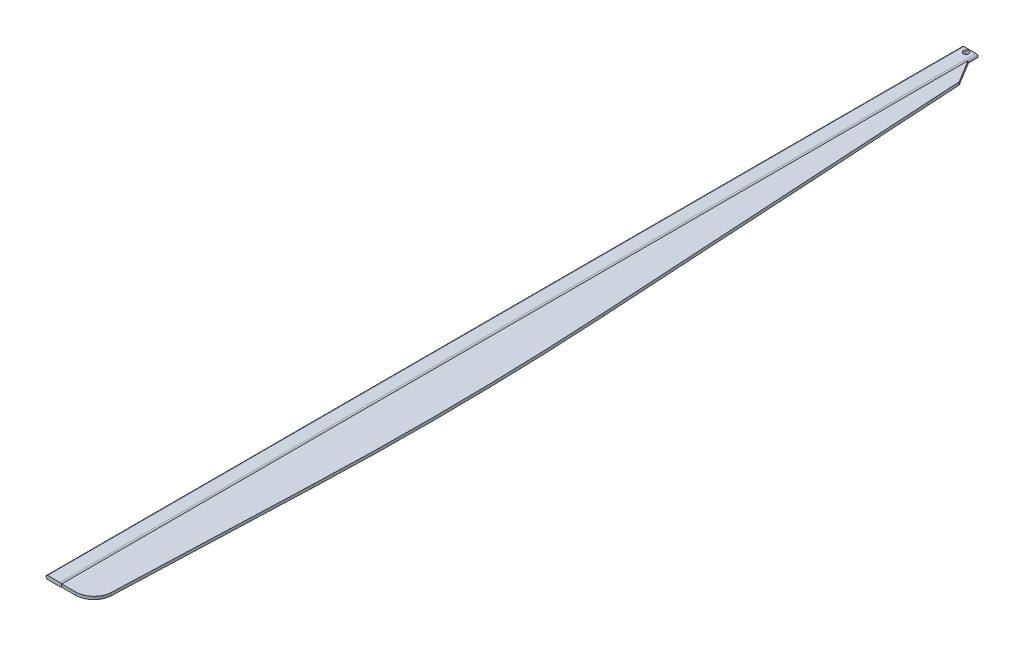
ISO-10303-21;
HEADER;
FILE_DESCRIPTION(('STEP AP214'),'2;1');
FILE_NAME('part.step','',(''),(''),'','','');
FILE_SCHEMA(('AUTOMOTIVE_DESIGN { 1 0 10303 214 1 1 1 1 }'));
ENDSEC;
DATA;
#1=APPLICATION_CONTEXT('core data for automotive mechanical design processes');
#2=APPLICATION_PROTOCOL_DEFINITION('international standard','automotive_design',2000,#1);
#3=PRODUCT_CONTEXT('',#1,'mechanical');
#4=PRODUCT('Part','Part','',(#3));
#5=PRODUCT_RELATED_PRODUCT_CATEGORY('part','',(#4));
#6=PRODUCT_DEFINITION_FORMATION('','',#4);
#7=PRODUCT_DEFINITION_CONTEXT('part definition',#1,'design');
#8=PRODUCT_DEFINITION('design','',#6,#7);
#9=PRODUCT_DEFINITION_SHAPE('','',#8);
#10=(LENGTH_UNIT() NAMED_UNIT(*) SI_UNIT(.MILLI.,.METRE.));
#11=(NAMED_UNIT(*) PLANE_ANGLE_UNIT() SI_UNIT($,.RADIAN.));
#12=(NAMED_UNIT(*) SI_UNIT($,.STERADIAN.) SOLID_ANGLE_UNIT());
#13=UNCERTAINTY_MEASURE_WITH_UNIT(LENGTH_MEASURE(1.E-05),#10,'distance_accuracy_value','');
#14=(GEOMETRIC_REPRESENTATION_CONTEXT(3) GLOBAL_UNCERTAINTY_ASSIGNED_CONTEXT((#13)) GLOBAL_UNIT_ASSIGNED_CONTEXT((#10,
#11,#12)) REPRESENTATION_CONTEXT('',''));
#15=CARTESIAN_POINT('',(0.,0.,0.));
#16=DIRECTION('',(0.,0.,1.));
#17=DIRECTION('',(1.,0.,0.));
#18=AXIS2_PLACEMENT_3D('',#15,#16,#17);
#19=CARTESIAN_POINT('',(215.000000000003,-40.,281.209140275877));
#20=DIRECTION('',(-1.,0.,0.));
#21=DIRECTION('',(0.,0.,1.));
#22=AXIS2_PLACEMENT_3D('',#19,#20,#21);
#23=PLANE('',#22);
#24=DIRECTION('',(0.,1.,0.));
#25=VECTOR('',#24,1.);
#26=CARTESIAN_POINT('',(215.000000000003,-40.,25000.));
#27=LINE('',#26,#25);
#28=CARTESIAN_POINT('',(215.000000000003,-40.,25000.));
#29=VERTEX_POINT('',#28);
#30=CARTESIAN_POINT('',(215.000000000003,40.,25000.));
#31=VERTEX_POINT('',#30);
#32=EDGE_CURVE('E52',#29,#31,#27,.T.);
#33=ORIENTED_EDGE('',*,*,#32,.T.);
#34=DIRECTION('',(0.,0.,1.));
#35=VECTOR('',#34,1.);
#36=CARTESIAN_POINT('',(215.000000000003,40.,281.209140275877));
#37=LINE('',#36,#35);
#38=CARTESIAN_POINT('',(215.000000000003,40.,281.209140275877));
#39=VERTEX_POINT('',#38);
#40=EDGE_CURVE('E107',#39,#31,#37,.T.);
#41=ORIENTED_EDGE('',*,*,#40,.F.);
#42=DIRECTION('',(0.,1.,0.));
#43=VECTOR('',#42,1.);
#44=CARTESIAN_POINT('',(215.000000000003,-40.,281.209140275877));
#45=LINE('',#44,#43);
#46=CARTESIAN_POINT('',(215.000000000003,-40.,281.209140275877));
#47=VERTEX_POINT('',#46);
#48=EDGE_CURVE('E12',#47,#39,#45,.T.);
#49=ORIENTED_EDGE('',*,*,#48,.F.);
#50=DIRECTION('',(0.,0.,1.));
#51=VECTOR('',#50,1.);
#52=CARTESIAN_POINT('',(215.000000000003,-40.,281.209140275877));
#53=LINE('',#52,#51);
#54=EDGE_CURVE('E108',#47,#29,#53,.T.);
#55=ORIENTED_EDGE('',*,*,#54,.T.);
#56=EDGE_LOOP('',(#33,#41,#49,#55));
#57=FACE_BOUND('',#56,.T.);
#58=ADVANCED_FACE('F49',(#57),#23,.T.);
#59=CARTESIAN_POINT('',(215.000000000003,-40.,281.209140275877));
#60=DIRECTION('',(0.855134403505708,0.,-0.518406357928736));
#61=DIRECTION('',(-0.518406357928736,0.,-0.855134403505708));
#62=AXIS2_PLACEMENT_3D('',#59,#60,#61);
#63=PLANE('',#62);
#64=ORIENTED_EDGE('',*,*,#48,.T.);
#65=DIRECTION('',(-0.518406357928736,0.,-0.855134403505708));
#66=VECTOR('',#65,1.);
#67=CARTESIAN_POINT('',(215.000000000003,40.,281.209140275877));
#68=LINE('',#67,#66);
#69=CARTESIAN_POINT('',(591.052452887572,40.,901.524429755942));
#70=VERTEX_POINT('',#69);
#71=EDGE_CURVE('E125',#70,#39,#68,.T.);
#72=ORIENTED_EDGE('',*,*,#71,.F.);
#73=DIRECTION('',(0.,1.,0.));
#74=VECTOR('',#73,1.);
#75=CARTESIAN_POINT('',(591.052452887572,-40.,901.524429755942));
#76=LINE('',#75,#74);
#77=CARTESIAN_POINT('',(591.052452887572,-40.,901.524429755942));
#78=VERTEX_POINT('',#77);
#79=EDGE_CURVE('E57',#78,#70,#76,.T.);
#80=ORIENTED_EDGE('',*,*,#79,.F.);
#81=DIRECTION('',(-0.518406357928736,0.,-0.855134403505708));
#82=VECTOR('',#81,1.);
#83=CARTESIAN_POINT('',(215.000000000003,-40.,281.209140275877));
#84=LINE('',#83,#82);
#85=EDGE_CURVE('E113',#78,#47,#84,.T.);
#86=ORIENTED_EDGE('',*,*,#85,.T.);
#87=EDGE_LOOP('',(#64,#72,#80,#86));
#88=FACE_BOUND('',#87,.T.);
#89=ADVANCED_FACE('F177',(#88),#63,.T.);
#90=CARTESIAN_POINT('',(591.052452887572,-40.,901.524429755942));
#91=DIRECTION('',(0.998260331691367,0.,-0.0589602422946364));
#92=DIRECTION('',(-0.0589602422946364,0.,-0.998260331691367));
#93=AXIS2_PLACEMENT_3D('',#90,#91,#92);
#94=PLANE('',#93);
#95=ORIENTED_EDGE('',*,*,#79,.T.);
#96=DIRECTION('',(-0.0589602422946364,0.,-0.998260331691367));
#97=VECTOR('',#96,1.);
#98=CARTESIAN_POINT('',(591.052452887572,40.,901.524429755942));
#99=LINE('',#98,#97);
#100=CARTESIAN_POINT('',(1200.85154338557,40.,11226.0790559672));
#101=VERTEX_POINT('',#100);
#102=EDGE_CURVE('E135',#101,#70,#99,.T.);
#103=ORIENTED_EDGE('',*,*,#102,.F.);
#104=DIRECTION('',(0.,1.,0.));
#105=VECTOR('',#104,1.);
#106=CARTESIAN_POINT('',(1200.85154338557,-40.,11226.0790559672));
#107=LINE('',#106,#105);
#108=CARTESIAN_POINT('',(1200.85154338557,-40.,11226.0790559672));
#109=VERTEX_POINT('',#108);
#110=EDGE_CURVE('E154',#109,#101,#107,.T.);
#111=ORIENTED_EDGE('',*,*,#110,.F.);
#112=DIRECTION('',(-0.0589602422946364,0.,-0.998260331691367));
#113=VECTOR('',#112,1.);
#114=CARTESIAN_POINT('',(591.052452887572,-40.,901.524429755942));
#115=LINE('',#114,#113);
#116=EDGE_CURVE('E150',#109,#78,#115,.T.);
#117=ORIENTED_EDGE('',*,*,#116,.T.);
#118=EDGE_LOOP('',(#95,#103,#111,#117));
#119=FACE_BOUND('',#118,.T.);
#120=ADVANCED_FACE('F175',(#119),#94,.T.);
#121=CARTESIAN_POINT('',(-81697.0591200943,-40.,16122.2777160468));
#122=DIRECTION('',(0.,1.,0.));
#123=DIRECTION('',(0.,0.,1.));
#124=AXIS2_PLACEMENT_3D('',#121,#122,#123);
#125=CYLINDRICAL_SURFACE('',#124,83042.3768547676);
#126=ORIENTED_EDGE('',*,*,#110,.T.);
#127=CARTESIAN_POINT('',(-81697.0591200943,40.,16122.2777160468));
#128=DIRECTION('',(0.,1.,0.));
#129=DIRECTION('',(0.,0.,-1.));
#130=AXIS2_PLACEMENT_3D('',#127,#128,#129);
#131=CIRCLE('',#130,83042.3768547676);
#132=CARTESIAN_POINT('',(1288.08855536347,40.,19204.7473382361));
#133=VERTEX_POINT('',#132);
#134=EDGE_CURVE('E132',#133,#101,#131,.T.);
#135=ORIENTED_EDGE('',*,*,#134,.F.);
#136=DIRECTION('',(0.,1.,0.));
#137=VECTOR('',#136,1.);
#138=CARTESIAN_POINT('',(1288.08855536347,-40.,19204.7473382361));
#139=LINE('',#138,#137);
#140=CARTESIAN_POINT('',(1288.08855536347,-40.,19204.7473382361));
#141=VERTEX_POINT('',#140);
#142=EDGE_CURVE('E156',#141,#133,#139,.T.);
#143=ORIENTED_EDGE('',*,*,#142,.F.);
#144=CARTESIAN_POINT('',(-81697.0591200943,-40.,16122.2777160468));
#145=DIRECTION('',(0.,1.,0.));
#146=DIRECTION('',(0.,0.,-1.));
#147=AXIS2_PLACEMENT_3D('',#144,#145,#146);
#148=CIRCLE('',#147,83042.3768547676);
#149=EDGE_CURVE('E147',#141,#109,#148,.T.);
#150=ORIENTED_EDGE('',*,*,#149,.T.);
#151=EDGE_LOOP('',(#126,#135,#143,#150));
#152=FACE_BOUND('',#151,.T.);
#153=ADVANCED_FACE('F169',(#152),#125,.T.);
#154=CARTESIAN_POINT('',(1288.08855536347,-40.,19204.7473382361));
#155=DIRECTION('',(0.999310843674309,0.,0.0371192364541807));
#156=DIRECTION('',(0.0371192364541807,0.,-0.999310843674309));
#157=AXIS2_PLACEMENT_3D('',#154,#155,#156);
#158=PLANE('',#157);
#159=ORIENTED_EDGE('',*,*,#142,.T.);
#160=DIRECTION('',(0.0371192364541807,0.,-0.999310843674309));
#161=VECTOR('',#160,1.);
#162=CARTESIAN_POINT('',(1288.08855536347,40.,19204.7473382361));
#163=LINE('',#162,#161);
#164=CARTESIAN_POINT('',(1090.70787472473,40.,24518.5596182271));
#165=VERTEX_POINT('',#164);
#166=EDGE_CURVE('E129',#165,#133,#163,.T.);
#167=ORIENTED_EDGE('',*,*,#166,.F.);
#168=DIRECTION('',(0.,1.,0.));
#169=VECTOR('',#168,1.);
#170=CARTESIAN_POINT('',(1090.70787472473,-40.,24518.5596182271));
#171=LINE('',#170,#169);
#172=CARTESIAN_POINT('',(1090.70787472473,-40.,24518.5596182271));
#173=VERTEX_POINT('',#172);
#174=EDGE_CURVE('E158',#173,#165,#171,.T.);
#175=ORIENTED_EDGE('',*,*,#174,.F.);
#176=DIRECTION('',(0.0371192364541807,0.,-0.999310843674309));
#177=VECTOR('',#176,1.);
#178=CARTESIAN_POINT('',(1288.08855536347,-40.,19204.7473382361));
#179=LINE('',#178,#177);
#180=EDGE_CURVE('E144',#173,#141,#179,.T.);
#181=ORIENTED_EDGE('',*,*,#180,.T.);
#182=EDGE_LOOP('',(#159,#167,#175,#181));
#183=FACE_BOUND('',#182,.T.);
#184=ADVANCED_FACE('F166',(#183),#158,.T.);
#185=CARTESIAN_POINT('',(591.052452887572,-40.,24500.));
#186=DIRECTION('',(0.,1.,0.));
#187=DIRECTION('',(0.,0.,1.));
#188=AXIS2_PLACEMENT_3D('',#185,#186,#187);
#189=CYLINDRICAL_SURFACE('',#188,500.);
#190=ORIENTED_EDGE('',*,*,#174,.T.);
#191=CARTESIAN_POINT('',(591.052452887572,40.,24500.));
#192=DIRECTION('',(0.,1.,0.));
#193=DIRECTION('',(0.,0.,-1.));
#194=AXIS2_PLACEMENT_3D('',#191,#192,#193);
#195=CIRCLE('',#194,500.);
#196=CARTESIAN_POINT('',(591.052452887572,40.,25000.));
#197=VERTEX_POINT('',#196);
#198=EDGE_CURVE('E120',#197,#165,#195,.T.);
#199=ORIENTED_EDGE('',*,*,#198,.F.);
#200=DIRECTION('',(0.,1.,0.));
#201=VECTOR('',#200,1.);
#202=CARTESIAN_POINT('',(591.052452887572,-40.,25000.));
#203=LINE('',#202,#201);
#204=CARTESIAN_POINT('',(591.052452887572,-40.,25000.));
#205=VERTEX_POINT('',#204);
#206=EDGE_CURVE('E112',#205,#197,#203,.T.);
#207=ORIENTED_EDGE('',*,*,#206,.F.);
#208=CARTESIAN_POINT('',(591.052452887572,-40.,24500.));
#209=DIRECTION('',(0.,1.,0.));
#210=DIRECTION('',(0.,0.,-1.));
#211=AXIS2_PLACEMENT_3D('',#208,#209,#210);
#212=CIRCLE('',#211,500.);
#213=EDGE_CURVE('E141',#205,#173,#212,.T.);
#214=ORIENTED_EDGE('',*,*,#213,.T.);
#215=EDGE_LOOP('',(#190,#199,#207,#214));
#216=FACE_BOUND('',#215,.T.);
#217=ADVANCED_FACE('F160',(#216),#189,.T.);
#218=CARTESIAN_POINT('',(591.052452887572,-40.,25000.));
#219=DIRECTION('',(0.,0.,1.));
#220=DIRECTION('',(1.,0.,0.));
#221=AXIS2_PLACEMENT_3D('',#218,#219,#220);
#222=PLANE('',#221);
#223=ORIENTED_EDGE('',*,*,#206,.T.);
#224=DIRECTION('',(1.,0.,0.));
#225=VECTOR('',#224,1.);
#226=CARTESIAN_POINT('',(591.052452887572,40.,25000.));
#227=LINE('',#226,#225);
#228=EDGE_CURVE('E115',#31,#197,#227,.T.);
#229=ORIENTED_EDGE('',*,*,#228,.F.);
#230=ORIENTED_EDGE('',*,*,#32,.F.);
#231=DIRECTION('',(1.,0.,0.));
#232=VECTOR('',#231,1.);
#233=CARTESIAN_POINT('',(591.052452887572,-40.,25000.));
#234=LINE('',#233,#232);
#235=EDGE_CURVE('E139',#29,#205,#234,.T.);
#236=ORIENTED_EDGE('',*,*,#235,.T.);
#237=EDGE_LOOP('',(#223,#229,#230,#236));
#238=FACE_BOUND('',#237,.T.);
#239=ADVANCED_FACE('F116',(#238),#222,.T.);
#240=CARTESIAN_POINT('',(591.052452887572,-40.,24500.));
#241=DIRECTION('',(0.,-1.,0.));
#242=DIRECTION('',(0.,0.,-1.));
#243=AXIS2_PLACEMENT_3D('',#240,#241,#242);
#244=PLANE('',#243);
#245=ORIENTED_EDGE('',*,*,#54,.F.);
#246=ORIENTED_EDGE('',*,*,#85,.F.);
#247=ORIENTED_EDGE('',*,*,#116,.F.);
#248=ORIENTED_EDGE('',*,*,#149,.F.);
#249=ORIENTED_EDGE('',*,*,#180,.F.);
#250=ORIENTED_EDGE('',*,*,#213,.F.);
#251=ORIENTED_EDGE('',*,*,#235,.F.);
#252=EDGE_LOOP('',(#245,#246,#247,#248,#249,#250,#251));
#253=FACE_BOUND('',#252,.T.);
#254=ADVANCED_FACE('F172',(#253),#244,.T.);
#255=CARTESIAN_POINT('',(591.052452887572,40.,24500.));
#256=DIRECTION('',(0.,-1.,0.));
#257=DIRECTION('',(0.,0.,-1.));
#258=AXIS2_PLACEMENT_3D('',#255,#256,#257);
#259=PLANE('',#258);
#260=ORIENTED_EDGE('',*,*,#40,.T.);
#261=ORIENTED_EDGE('',*,*,#228,.T.);
#262=ORIENTED_EDGE('',*,*,#198,.T.);
#263=ORIENTED_EDGE('',*,*,#166,.T.);
#264=ORIENTED_EDGE('',*,*,#134,.T.);
#265=ORIENTED_EDGE('',*,*,#102,.T.);
#266=ORIENTED_EDGE('',*,*,#71,.T.);
#267=EDGE_LOOP('',(#260,#261,#262,#263,#264,#265,#266));
#268=FACE_BOUND('',#267,.T.);
#269=ADVANCED_FACE('F123',(#268),#259,.F.);
#270=CLOSED_SHELL('',(#58,#89,#120,#153,#184,#217,#239,#254,#269));
#271=MANIFOLD_SOLID_BREP('B2',#270);
#272=CARTESIAN_POINT('',(-165.,0.,0.));
#273=DIRECTION('',(0.,0.,1.));
#274=DIRECTION('',(1.,0.,0.));
#275=AXIS2_PLACEMENT_3D('',#272,#273,#274);
#276=PLANE('',#275);
#277=CARTESIAN_POINT('',(-165.,0.,0.));
#278=DIRECTION('',(0.,0.,1.));
#279=DIRECTION('',(1.,0.,0.));
#280=AXIS2_PLACEMENT_3D('',#277,#278,#279);
#281=CIRCLE('',#280,30.);
#282=CARTESIAN_POINT('',(-165.,-30.0000000000001,0.));
#283=VERTEX_POINT('',#282);
#284=CARTESIAN_POINT('',(-165.,30.,0.));
#285=VERTEX_POINT('',#284);
#286=EDGE_CURVE('E343',#283,#285,#281,.F.);
#287=ORIENTED_EDGE('',*,*,#286,.T.);
#288=DIRECTION('',(-1.,0.,0.));
#289=VECTOR('',#288,1.);
#290=CARTESIAN_POINT('',(165.,30.,0.));
#291=LINE('',#290,#289);
#292=CARTESIAN_POINT('',(165.,30.0000000000001,0.));
#293=VERTEX_POINT('',#292);
#294=EDGE_CURVE('E349',#285,#293,#291,.F.);
#295=ORIENTED_EDGE('',*,*,#294,.T.);
#296=CARTESIAN_POINT('',(165.,0.,0.));
#297=DIRECTION('',(0.,0.,1.));
#298=DIRECTION('',(1.,0.,0.));
#299=AXIS2_PLACEMENT_3D('',#296,#297,#298);
#300=CIRCLE('',#299,30.);
#301=CARTESIAN_POINT('',(165.,-30.,0.));
#302=VERTEX_POINT('',#301);
#303=EDGE_CURVE('E347',#293,#302,#300,.F.);
#304=ORIENTED_EDGE('',*,*,#303,.T.);
#305=DIRECTION('',(1.,0.,0.));
#306=VECTOR('',#305,1.);
#307=CARTESIAN_POINT('',(-165.,-30.,0.));
#308=LINE('',#307,#306);
#309=EDGE_CURVE('E345',#302,#283,#308,.F.);
#310=ORIENTED_EDGE('',*,*,#309,.T.);
#311=EDGE_LOOP('',(#287,#295,#304,#310));
#312=FACE_BOUND('',#311,.T.);
#313=ADVANCED_FACE('F251',(#312),#276,.F.);
#314=CARTESIAN_POINT('',(-164.999999999997,0.,25000.));
#315=DIRECTION('',(0.,0.,1.));
#316=DIRECTION('',(1.,0.,0.));
#317=AXIS2_PLACEMENT_3D('',#314,#315,#316);
#318=PLANE('',#317);
#319=CARTESIAN_POINT('',(-164.999999999997,0.,25000.));
#320=DIRECTION('',(0.,0.,1.));
#321=DIRECTION('',(1.,0.,0.));
#322=AXIS2_PLACEMENT_3D('',#319,#320,#321);
#323=CIRCLE('',#322,50.);
#324=CARTESIAN_POINT('',(-164.999999999997,50.,25000.));
#325=VERTEX_POINT('',#324);
#326=CARTESIAN_POINT('',(-164.999999999997,-50.,25000.));
#327=VERTEX_POINT('',#326);
#328=EDGE_CURVE('E331',#325,#327,#323,.T.);
#329=ORIENTED_EDGE('',*,*,#328,.T.);
#330=DIRECTION('',(1.,0.,0.));
#331=VECTOR('',#330,1.);
#332=CARTESIAN_POINT('',(-164.999999999997,-50.,25000.));
#333=LINE('',#332,#331);
#334=CARTESIAN_POINT('',(165.000000000003,-50.,25000.));
#335=VERTEX_POINT('',#334);
#336=EDGE_CURVE('E324',#327,#335,#333,.T.);
#337=ORIENTED_EDGE('',*,*,#336,.T.);
#338=CARTESIAN_POINT('',(165.000000000003,0.,25000.));
#339=DIRECTION('',(0.,0.,1.));
#340=DIRECTION('',(1.,0.,0.));
#341=AXIS2_PLACEMENT_3D('',#338,#339,#340);
#342=CIRCLE('',#341,50.);
#343=CARTESIAN_POINT('',(165.000000000003,50.,25000.));
#344=VERTEX_POINT('',#343);
#345=EDGE_CURVE('E307',#335,#344,#342,.T.);
#346=ORIENTED_EDGE('',*,*,#345,.T.);
#347=DIRECTION('',(-1.,0.,0.));
#348=VECTOR('',#347,1.);
#349=CARTESIAN_POINT('',(-164.999999999997,50.,25000.));
#350=LINE('',#349,#348);
#351=EDGE_CURVE('E314',#344,#325,#350,.T.);
#352=ORIENTED_EDGE('',*,*,#351,.T.);
#353=EDGE_LOOP('',(#329,#337,#346,#352));
#354=FACE_BOUND('',#353,.T.);
#355=ADVANCED_FACE('F321',(#354),#318,.T.);
#356=CARTESIAN_POINT('',(-165.,50.,0.));
#357=DIRECTION('',(0.,1.,0.));
#358=DIRECTION('',(0.,0.,1.));
#359=AXIS2_PLACEMENT_3D('',#356,#357,#358);
#360=PLANE('',#359);
#361=CARTESIAN_POINT('',(0.,50.,120.));
#362=DIRECTION('',(0.,1.,0.));
#363=DIRECTION('',(0.,0.,1.));
#364=AXIS2_PLACEMENT_3D('',#361,#362,#363);
#365=CIRCLE('',#364,75.);
#366=CARTESIAN_POINT('',(0.,50.,195.));
#367=VERTEX_POINT('',#366);
#368=EDGE_CURVE('E334',#367,#367,#365,.T.);
#369=ORIENTED_EDGE('',*,*,#368,.F.);
#370=EDGE_LOOP('',(#369));
#371=FACE_BOUND('',#370,.T.);
#372=DIRECTION('',(0.,0.,1.));
#373=VECTOR('',#372,1.);
#374=CARTESIAN_POINT('',(165.,50.,0.));
#375=LINE('',#374,#373);
#376=CARTESIAN_POINT('',(165.,50.,20.));
#377=VERTEX_POINT('',#376);
#378=EDGE_CURVE('E304',#377,#344,#375,.T.);
#379=ORIENTED_EDGE('',*,*,#378,.F.);
#380=DIRECTION('',(-1.,0.,0.));
#381=VECTOR('',#380,1.);
#382=CARTESIAN_POINT('',(-165.,50.,20.));
#383=LINE('',#382,#381);
#384=CARTESIAN_POINT('',(-165.,50.,20.));
#385=VERTEX_POINT('',#384);
#386=EDGE_CURVE('E325',#377,#385,#383,.T.);
#387=ORIENTED_EDGE('',*,*,#386,.T.);
#388=DIRECTION('',(0.,0.,1.));
#389=VECTOR('',#388,1.);
#390=CARTESIAN_POINT('',(-165.,50.,0.));
#391=LINE('',#390,#389);
#392=EDGE_CURVE('E329',#385,#325,#391,.T.);
#393=ORIENTED_EDGE('',*,*,#392,.T.);
#394=ORIENTED_EDGE('',*,*,#351,.F.);
#395=EDGE_LOOP('',(#379,#387,#393,#394));
#396=FACE_BOUND('',#395,.T.);
#397=ADVANCED_FACE('F328',(#371,#396),#360,.T.);
#398=CARTESIAN_POINT('',(-165.,0.,0.));
#399=DIRECTION('',(0.,0.,1.));
#400=DIRECTION('',(1.,0.,0.));
#401=AXIS2_PLACEMENT_3D('',#398,#399,#400);
#402=CYLINDRICAL_SURFACE('',#401,50.);
#403=ORIENTED_EDGE('',*,*,#392,.F.);
#404=CARTESIAN_POINT('',(-165.,0.,20.));
#405=DIRECTION('',(0.,0.,1.));
#406=DIRECTION('',(1.,0.,0.));
#407=AXIS2_PLACEMENT_3D('',#404,#405,#406);
#408=CIRCLE('',#407,50.);
#409=CARTESIAN_POINT('',(-165.,-50.,20.));
#410=VERTEX_POINT('',#409);
#411=EDGE_CURVE('E47',#385,#410,#408,.T.);
#412=ORIENTED_EDGE('',*,*,#411,.T.);
#413=DIRECTION('',(0.,0.,1.));
#414=VECTOR('',#413,1.);
#415=CARTESIAN_POINT('',(-165.,-50.,0.));
#416=LINE('',#415,#414);
#417=EDGE_CURVE('E338',#410,#327,#416,.T.);
#418=ORIENTED_EDGE('',*,*,#417,.T.);
#419=ORIENTED_EDGE('',*,*,#328,.F.);
#420=EDGE_LOOP('',(#403,#412,#418,#419));
#421=FACE_BOUND('',#420,.T.);
#422=ADVANCED_FACE('F439',(#421),#402,.T.);
#423=CARTESIAN_POINT('',(-165.,-50.,0.));
#424=DIRECTION('',(0.,-1.,0.));
#425=DIRECTION('',(0.,0.,-1.));
#426=AXIS2_PLACEMENT_3D('',#423,#424,#425);
#427=PLANE('',#426);
#428=CARTESIAN_POINT('',(0.,-50.,120.));
#429=DIRECTION('',(0.,1.,0.));
#430=DIRECTION('',(0.,0.,1.));
#431=AXIS2_PLACEMENT_3D('',#428,#429,#430);
#432=CIRCLE('',#431,75.);
#433=CARTESIAN_POINT('',(0.,-50.,195.));
#434=VERTEX_POINT('',#433);
#435=EDGE_CURVE('E315',#434,#434,#432,.T.);
#436=ORIENTED_EDGE('',*,*,#435,.T.);
#437=EDGE_LOOP('',(#436));
#438=FACE_BOUND('',#437,.T.);
#439=ORIENTED_EDGE('',*,*,#417,.F.);
#440=DIRECTION('',(1.,0.,0.));
#441=VECTOR('',#440,1.);
#442=CARTESIAN_POINT('',(165.,-50.,20.));
#443=LINE('',#442,#441);
#444=CARTESIAN_POINT('',(165.,-50.,20.));
#445=VERTEX_POINT('',#444);
#446=EDGE_CURVE('E260',#410,#445,#443,.T.);
#447=ORIENTED_EDGE('',*,*,#446,.T.);
#448=DIRECTION('',(0.,0.,1.));
#449=VECTOR('',#448,1.);
#450=CARTESIAN_POINT('',(165.,-50.,0.));
#451=LINE('',#450,#449);
#452=EDGE_CURVE('E326',#445,#335,#451,.T.);
#453=ORIENTED_EDGE('',*,*,#452,.T.);
#454=ORIENTED_EDGE('',*,*,#336,.F.);
#455=EDGE_LOOP('',(#439,#447,#453,#454));
#456=FACE_BOUND('',#455,.T.);
#457=ADVANCED_FACE('F372',(#438,#456),#427,.T.);
#458=CARTESIAN_POINT('',(165.,0.,0.));
#459=DIRECTION('',(0.,0.,1.));
#460=DIRECTION('',(1.,0.,0.));
#461=AXIS2_PLACEMENT_3D('',#458,#459,#460);
#462=CYLINDRICAL_SURFACE('',#461,50.);
#463=ORIENTED_EDGE('',*,*,#452,.F.);
#464=CARTESIAN_POINT('',(165.,0.,20.));
#465=DIRECTION('',(0.,0.,1.));
#466=DIRECTION('',(1.,0.,0.));
#467=AXIS2_PLACEMENT_3D('',#464,#465,#466);
#468=CIRCLE('',#467,50.);
#469=EDGE_CURVE('E309',#445,#377,#468,.T.);
#470=ORIENTED_EDGE('',*,*,#469,.T.);
#471=ORIENTED_EDGE('',*,*,#378,.T.);
#472=ORIENTED_EDGE('',*,*,#345,.F.);
#473=EDGE_LOOP('',(#463,#470,#471,#472));
#474=FACE_BOUND('',#473,.T.);
#475=ADVANCED_FACE('F306',(#474),#462,.T.);
#476=CARTESIAN_POINT('',(0.,-50.,120.));
#477=DIRECTION('',(0.,1.,0.));
#478=DIRECTION('',(0.,0.,1.));
#479=AXIS2_PLACEMENT_3D('',#476,#477,#478);
#480=CYLINDRICAL_SURFACE('',#479,75.);
#481=ORIENTED_EDGE('',*,*,#435,.F.);
#482=EDGE_LOOP('',(#481));
#483=FACE_BOUND('',#482,.T.);
#484=ORIENTED_EDGE('',*,*,#368,.T.);
#485=EDGE_LOOP('',(#484));
#486=FACE_BOUND('',#485,.T.);
#487=ADVANCED_FACE('F374',(#483,#486),#480,.F.);
#488=CARTESIAN_POINT('',(-165.,-30.,20.));
#489=DIRECTION('',(-1.,0.,0.));
#490=DIRECTION('',(0.,0.,1.));
#491=AXIS2_PLACEMENT_3D('',#488,#489,#490);
#492=CYLINDRICAL_SURFACE('',#491,20.);
#493=CARTESIAN_POINT('',(-165.,-30.,20.));
#494=DIRECTION('',(-1.,0.,0.));
#495=DIRECTION('',(0.,0.,1.));
#496=AXIS2_PLACEMENT_3D('',#493,#494,#495);
#497=CIRCLE('',#496,20.);
#498=EDGE_CURVE('E357',#283,#410,#497,.T.);
#499=ORIENTED_EDGE('',*,*,#498,.F.);
#500=ORIENTED_EDGE('',*,*,#309,.F.);
#501=CARTESIAN_POINT('',(165.,-30.,20.));
#502=DIRECTION('',(1.,0.,0.));
#503=DIRECTION('',(0.,0.,-1.));
#504=AXIS2_PLACEMENT_3D('',#501,#502,#503);
#505=CIRCLE('',#504,20.);
#506=EDGE_CURVE('E255',#445,#302,#505,.T.);
#507=ORIENTED_EDGE('',*,*,#506,.F.);
#508=ORIENTED_EDGE('',*,*,#446,.F.);
#509=EDGE_LOOP('',(#499,#500,#507,#508));
#510=FACE_BOUND('',#509,.T.);
#511=ADVANCED_FACE('F253',(#510),#492,.T.);
#512=CARTESIAN_POINT('',(165.,0.,20.));
#513=DIRECTION('',(0.,0.,1.));
#514=DIRECTION('',(1.,0.,0.));
#515=AXIS2_PLACEMENT_3D('',#512,#513,#514);
#516=TOROIDAL_SURFACE('',#515,30.,20.);
#517=ORIENTED_EDGE('',*,*,#506,.T.);
#518=ORIENTED_EDGE('',*,*,#303,.F.);
#519=CARTESIAN_POINT('',(165.,30.,20.));
#520=DIRECTION('',(-1.,0.,0.));
#521=DIRECTION('',(0.,0.,1.));
#522=AXIS2_PLACEMENT_3D('',#519,#520,#521);
#523=CIRCLE('',#522,20.);
#524=EDGE_CURVE('E356',#377,#293,#523,.T.);
#525=ORIENTED_EDGE('',*,*,#524,.F.);
#526=ORIENTED_EDGE('',*,*,#469,.F.);
#527=EDGE_LOOP('',(#517,#518,#525,#526));
#528=FACE_BOUND('',#527,.T.);
#529=ADVANCED_FACE('F382',(#528),#516,.T.);
#530=CARTESIAN_POINT('',(-165.,0.,20.));
#531=DIRECTION('',(0.,0.,1.));
#532=DIRECTION('',(1.,0.,0.));
#533=AXIS2_PLACEMENT_3D('',#530,#531,#532);
#534=TOROIDAL_SURFACE('',#533,30.,20.);
#535=ORIENTED_EDGE('',*,*,#498,.T.);
#536=ORIENTED_EDGE('',*,*,#411,.F.);
#537=CARTESIAN_POINT('',(-165.,30.,20.));
#538=DIRECTION('',(1.,0.,0.));
#539=DIRECTION('',(0.,0.,-1.));
#540=AXIS2_PLACEMENT_3D('',#537,#538,#539);
#541=CIRCLE('',#540,20.);
#542=EDGE_CURVE('E354',#285,#385,#541,.T.);
#543=ORIENTED_EDGE('',*,*,#542,.F.);
#544=ORIENTED_EDGE('',*,*,#286,.F.);
#545=EDGE_LOOP('',(#535,#536,#543,#544));
#546=FACE_BOUND('',#545,.T.);
#547=ADVANCED_FACE('F397',(#546),#534,.T.);
#548=CARTESIAN_POINT('',(-165.,30.,20.));
#549=DIRECTION('',(1.,0.,0.));
#550=DIRECTION('',(0.,0.,-1.));
#551=AXIS2_PLACEMENT_3D('',#548,#549,#550);
#552=CYLINDRICAL_SURFACE('',#551,20.);
#553=ORIENTED_EDGE('',*,*,#524,.T.);
#554=ORIENTED_EDGE('',*,*,#294,.F.);
#555=ORIENTED_EDGE('',*,*,#542,.T.);
#556=ORIENTED_EDGE('',*,*,#386,.F.);
#557=EDGE_LOOP('',(#553,#554,#555,#556));
#558=FACE_BOUND('',#557,.T.);
#559=ADVANCED_FACE('F394',(#558),#552,.T.);
#560=CLOSED_SHELL('',(#313,#355,#397,#422,#457,#475,#487,#511,#529,#547,#559));
#561=MANIFOLD_SOLID_BREP('B6',#560);
#562=ADVANCED_BREP_SHAPE_REPRESENTATION('',(#18,#271,#561),#14);
#563=SHAPE_DEFINITION_REPRESENTATION(#9,#562);
ENDSEC;
END-ISO-10303-21;
